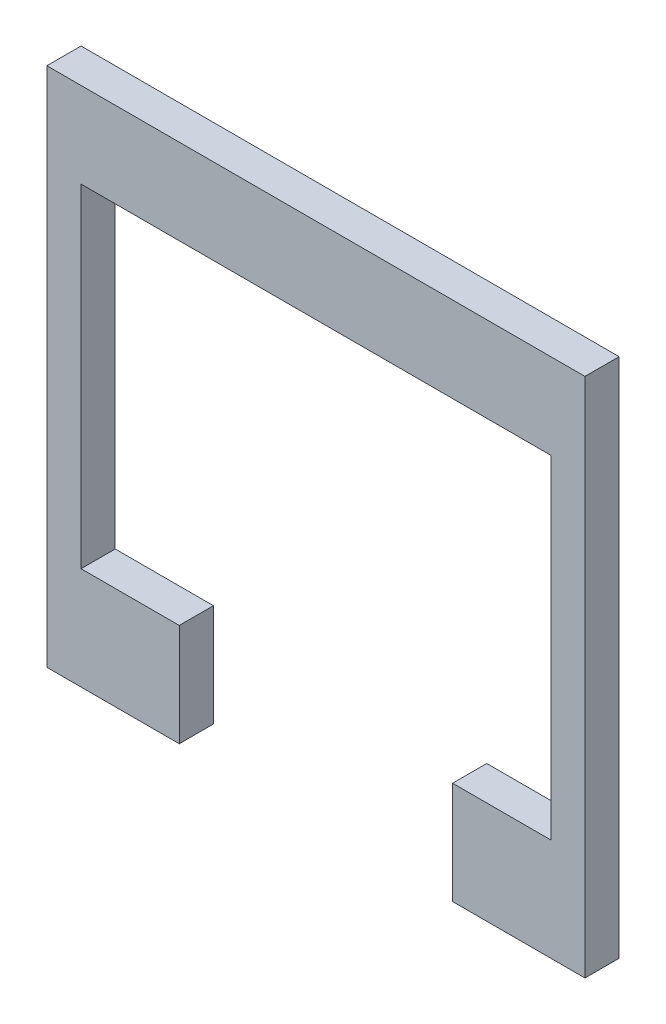
ISO-10303-21;
HEADER;
FILE_DESCRIPTION(('STEP AP214'),'2;1');
FILE_NAME('part.step','',(''),(''),'','','');
FILE_SCHEMA(('AUTOMOTIVE_DESIGN { 1 0 10303 214 1 1 1 1 }'));
ENDSEC;
DATA;
#1=APPLICATION_CONTEXT('core data for automotive mechanical design processes');
#2=APPLICATION_PROTOCOL_DEFINITION('international standard','automotive_design',2000,#1);
#3=PRODUCT_CONTEXT('',#1,'mechanical');
#4=PRODUCT('Part','Part','',(#3));
#5=PRODUCT_RELATED_PRODUCT_CATEGORY('part','',(#4));
#6=PRODUCT_DEFINITION_FORMATION('','',#4);
#7=PRODUCT_DEFINITION_CONTEXT('part definition',#1,'design');
#8=PRODUCT_DEFINITION('design','',#6,#7);
#9=PRODUCT_DEFINITION_SHAPE('','',#8);
#10=(LENGTH_UNIT() NAMED_UNIT(*) SI_UNIT(.MILLI.,.METRE.));
#11=(NAMED_UNIT(*) PLANE_ANGLE_UNIT() SI_UNIT($,.RADIAN.));
#12=(NAMED_UNIT(*) SI_UNIT($,.STERADIAN.) SOLID_ANGLE_UNIT());
#13=UNCERTAINTY_MEASURE_WITH_UNIT(LENGTH_MEASURE(1.E-05),#10,'distance_accuracy_value','');
#14=(GEOMETRIC_REPRESENTATION_CONTEXT(3) GLOBAL_UNCERTAINTY_ASSIGNED_CONTEXT((#13)) GLOBAL_UNIT_ASSIGNED_CONTEXT((#10,
#11,#12)) REPRESENTATION_CONTEXT('',''));
#15=CARTESIAN_POINT('',(0.,0.,0.));
#16=DIRECTION('',(0.,0.,1.));
#17=DIRECTION('',(1.,0.,0.));
#18=AXIS2_PLACEMENT_3D('',#15,#16,#17);
#19=CARTESIAN_POINT('',(13.75,-11.25,2.));
#20=DIRECTION('',(1.,0.,0.));
#21=DIRECTION('',(0.,0.,-1.));
#22=AXIS2_PLACEMENT_3D('',#19,#20,#21);
#23=PLANE('',#22);
#24=DIRECTION('',(0.,-1.,0.));
#25=VECTOR('',#24,1.);
#26=CARTESIAN_POINT('',(13.75,-11.25,0.));
#27=LINE('',#26,#25);
#28=CARTESIAN_POINT('',(13.75,8.25,0.));
#29=VERTEX_POINT('',#28);
#30=CARTESIAN_POINT('',(13.75,-11.25,0.));
#31=VERTEX_POINT('',#30);
#32=EDGE_CURVE('E153',#29,#31,#27,.T.);
#33=ORIENTED_EDGE('',*,*,#32,.T.);
#34=DIRECTION('',(0.,0.,-1.));
#35=VECTOR('',#34,1.);
#36=CARTESIAN_POINT('',(13.75,-11.25,2.));
#37=LINE('',#36,#35);
#38=CARTESIAN_POINT('',(13.75,-11.25,2.));
#39=VERTEX_POINT('',#38);
#40=EDGE_CURVE('E11',#39,#31,#37,.T.);
#41=ORIENTED_EDGE('',*,*,#40,.F.);
#42=DIRECTION('',(0.,-1.,0.));
#43=VECTOR('',#42,1.);
#44=CARTESIAN_POINT('',(13.75,-11.25,2.));
#45=LINE('',#44,#43);
#46=CARTESIAN_POINT('',(13.75,8.25,2.));
#47=VERTEX_POINT('',#46);
#48=EDGE_CURVE('E175',#47,#39,#45,.T.);
#49=ORIENTED_EDGE('',*,*,#48,.F.);
#50=DIRECTION('',(0.,0.,-1.));
#51=VECTOR('',#50,1.);
#52=CARTESIAN_POINT('',(13.75,8.25,2.));
#53=LINE('',#52,#51);
#54=EDGE_CURVE('E149',#47,#29,#53,.T.);
#55=ORIENTED_EDGE('',*,*,#54,.T.);
#56=EDGE_LOOP('',(#33,#41,#49,#55));
#57=FACE_BOUND('',#56,.T.);
#58=ADVANCED_FACE('F33',(#57),#23,.F.);
#59=CARTESIAN_POINT('',(8.,-11.25,2.));
#60=DIRECTION('',(0.,-1.,0.));
#61=DIRECTION('',(0.,0.,-1.));
#62=AXIS2_PLACEMENT_3D('',#59,#60,#61);
#63=PLANE('',#62);
#64=DIRECTION('',(-1.,0.,0.));
#65=VECTOR('',#64,1.);
#66=CARTESIAN_POINT('',(8.,-11.25,0.));
#67=LINE('',#66,#65);
#68=CARTESIAN_POINT('',(8.,-11.25,0.));
#69=VERTEX_POINT('',#68);
#70=EDGE_CURVE('E156',#31,#69,#67,.T.);
#71=ORIENTED_EDGE('',*,*,#70,.T.);
#72=DIRECTION('',(0.,0.,-1.));
#73=VECTOR('',#72,1.);
#74=CARTESIAN_POINT('',(8.,-11.25,2.));
#75=LINE('',#74,#73);
#76=CARTESIAN_POINT('',(8.,-11.25,2.));
#77=VERTEX_POINT('',#76);
#78=EDGE_CURVE('E41',#77,#69,#75,.T.);
#79=ORIENTED_EDGE('',*,*,#78,.F.);
#80=DIRECTION('',(-1.,0.,0.));
#81=VECTOR('',#80,1.);
#82=CARTESIAN_POINT('',(8.,-11.25,2.));
#83=LINE('',#82,#81);
#84=EDGE_CURVE('E104',#39,#77,#83,.T.);
#85=ORIENTED_EDGE('',*,*,#84,.F.);
#86=ORIENTED_EDGE('',*,*,#40,.T.);
#87=EDGE_LOOP('',(#71,#79,#85,#86));
#88=FACE_BOUND('',#87,.T.);
#89=ADVANCED_FACE('F253',(#88),#63,.F.);
#90=CARTESIAN_POINT('',(8.,-11.25,2.));
#91=DIRECTION('',(1.,0.,0.));
#92=DIRECTION('',(0.,0.,-1.));
#93=AXIS2_PLACEMENT_3D('',#90,#91,#92);
#94=PLANE('',#93);
#95=DIRECTION('',(0.,-1.,0.));
#96=VECTOR('',#95,1.);
#97=CARTESIAN_POINT('',(8.,-11.25,0.));
#98=LINE('',#97,#96);
#99=CARTESIAN_POINT('',(8.,-17.25,0.));
#100=VERTEX_POINT('',#99);
#101=EDGE_CURVE('E158',#69,#100,#98,.T.);
#102=ORIENTED_EDGE('',*,*,#101,.T.);
#103=DIRECTION('',(0.,0.,-1.));
#104=VECTOR('',#103,1.);
#105=CARTESIAN_POINT('',(8.,-17.25,2.));
#106=LINE('',#105,#104);
#107=CARTESIAN_POINT('',(8.,-17.25,2.));
#108=VERTEX_POINT('',#107);
#109=EDGE_CURVE('E194',#108,#100,#106,.T.);
#110=ORIENTED_EDGE('',*,*,#109,.F.);
#111=DIRECTION('',(0.,-1.,0.));
#112=VECTOR('',#111,1.);
#113=CARTESIAN_POINT('',(8.,-11.25,2.));
#114=LINE('',#113,#112);
#115=EDGE_CURVE('E202',#77,#108,#114,.T.);
#116=ORIENTED_EDGE('',*,*,#115,.F.);
#117=ORIENTED_EDGE('',*,*,#78,.T.);
#118=EDGE_LOOP('',(#102,#110,#116,#117));
#119=FACE_BOUND('',#118,.T.);
#120=ADVANCED_FACE('F200',(#119),#94,.F.);
#121=CARTESIAN_POINT('',(8.,-17.25,2.));
#122=DIRECTION('',(0.,1.,0.));
#123=DIRECTION('',(0.,0.,1.));
#124=AXIS2_PLACEMENT_3D('',#121,#122,#123);
#125=PLANE('',#124);
#126=DIRECTION('',(1.,0.,0.));
#127=VECTOR('',#126,1.);
#128=CARTESIAN_POINT('',(8.,-17.25,0.));
#129=LINE('',#128,#127);
#130=CARTESIAN_POINT('',(15.75,-17.25,0.));
#131=VERTEX_POINT('',#130);
#132=EDGE_CURVE('E160',#100,#131,#129,.T.);
#133=ORIENTED_EDGE('',*,*,#132,.T.);
#134=DIRECTION('',(0.,0.,-1.));
#135=VECTOR('',#134,1.);
#136=CARTESIAN_POINT('',(15.75,-17.25,2.));
#137=LINE('',#136,#135);
#138=CARTESIAN_POINT('',(15.75,-17.25,2.));
#139=VERTEX_POINT('',#138);
#140=EDGE_CURVE('E191',#139,#131,#137,.T.);
#141=ORIENTED_EDGE('',*,*,#140,.F.);
#142=DIRECTION('',(1.,0.,0.));
#143=VECTOR('',#142,1.);
#144=CARTESIAN_POINT('',(8.,-17.25,2.));
#145=LINE('',#144,#143);
#146=EDGE_CURVE('E220',#108,#139,#145,.T.);
#147=ORIENTED_EDGE('',*,*,#146,.F.);
#148=ORIENTED_EDGE('',*,*,#109,.T.);
#149=EDGE_LOOP('',(#133,#141,#147,#148));
#150=FACE_BOUND('',#149,.T.);
#151=ADVANCED_FACE('F211',(#150),#125,.F.);
#152=CARTESIAN_POINT('',(15.75,13.25,2.));
#153=DIRECTION('',(-1.,0.,0.));
#154=DIRECTION('',(0.,0.,1.));
#155=AXIS2_PLACEMENT_3D('',#152,#153,#154);
#156=PLANE('',#155);
#157=DIRECTION('',(0.,1.,0.));
#158=VECTOR('',#157,1.);
#159=CARTESIAN_POINT('',(15.75,13.25,0.));
#160=LINE('',#159,#158);
#161=CARTESIAN_POINT('',(15.75,13.25,0.));
#162=VERTEX_POINT('',#161);
#163=EDGE_CURVE('E162',#131,#162,#160,.T.);
#164=ORIENTED_EDGE('',*,*,#163,.T.);
#165=DIRECTION('',(0.,0.,-1.));
#166=VECTOR('',#165,1.);
#167=CARTESIAN_POINT('',(15.75,13.25,2.));
#168=LINE('',#167,#166);
#169=CARTESIAN_POINT('',(15.75,13.25,2.));
#170=VERTEX_POINT('',#169);
#171=EDGE_CURVE('E188',#170,#162,#168,.T.);
#172=ORIENTED_EDGE('',*,*,#171,.F.);
#173=DIRECTION('',(0.,1.,0.));
#174=VECTOR('',#173,1.);
#175=CARTESIAN_POINT('',(15.75,13.25,2.));
#176=LINE('',#175,#174);
#177=EDGE_CURVE('E217',#139,#170,#176,.T.);
#178=ORIENTED_EDGE('',*,*,#177,.F.);
#179=ORIENTED_EDGE('',*,*,#140,.T.);
#180=EDGE_LOOP('',(#164,#172,#178,#179));
#181=FACE_BOUND('',#180,.T.);
#182=ADVANCED_FACE('F215',(#181),#156,.F.);
#183=CARTESIAN_POINT('',(-15.75,13.25,2.));
#184=DIRECTION('',(0.,-1.,0.));
#185=DIRECTION('',(0.,0.,-1.));
#186=AXIS2_PLACEMENT_3D('',#183,#184,#185);
#187=PLANE('',#186);
#188=DIRECTION('',(-1.,0.,0.));
#189=VECTOR('',#188,1.);
#190=CARTESIAN_POINT('',(-15.75,13.25,0.));
#191=LINE('',#190,#189);
#192=CARTESIAN_POINT('',(-15.75,13.25,0.));
#193=VERTEX_POINT('',#192);
#194=EDGE_CURVE('E164',#162,#193,#191,.T.);
#195=ORIENTED_EDGE('',*,*,#194,.T.);
#196=DIRECTION('',(0.,0.,-1.));
#197=VECTOR('',#196,1.);
#198=CARTESIAN_POINT('',(-15.75,13.25,2.));
#199=LINE('',#198,#197);
#200=CARTESIAN_POINT('',(-15.75,13.25,2.));
#201=VERTEX_POINT('',#200);
#202=EDGE_CURVE('E185',#201,#193,#199,.T.);
#203=ORIENTED_EDGE('',*,*,#202,.F.);
#204=DIRECTION('',(-1.,0.,0.));
#205=VECTOR('',#204,1.);
#206=CARTESIAN_POINT('',(-15.75,13.25,2.));
#207=LINE('',#206,#205);
#208=EDGE_CURVE('E219',#170,#201,#207,.T.);
#209=ORIENTED_EDGE('',*,*,#208,.F.);
#210=ORIENTED_EDGE('',*,*,#171,.T.);
#211=EDGE_LOOP('',(#195,#203,#209,#210));
#212=FACE_BOUND('',#211,.T.);
#213=ADVANCED_FACE('F266',(#212),#187,.F.);
#214=CARTESIAN_POINT('',(-15.75,13.25,2.));
#215=DIRECTION('',(1.,0.,0.));
#216=DIRECTION('',(0.,0.,-1.));
#217=AXIS2_PLACEMENT_3D('',#214,#215,#216);
#218=PLANE('',#217);
#219=DIRECTION('',(0.,-1.,0.));
#220=VECTOR('',#219,1.);
#221=CARTESIAN_POINT('',(-15.75,13.25,0.));
#222=LINE('',#221,#220);
#223=CARTESIAN_POINT('',(-15.75,-17.25,0.));
#224=VERTEX_POINT('',#223);
#225=EDGE_CURVE('E166',#193,#224,#222,.T.);
#226=ORIENTED_EDGE('',*,*,#225,.T.);
#227=DIRECTION('',(0.,0.,-1.));
#228=VECTOR('',#227,1.);
#229=CARTESIAN_POINT('',(-15.75,-17.25,2.));
#230=LINE('',#229,#228);
#231=CARTESIAN_POINT('',(-15.75,-17.25,2.));
#232=VERTEX_POINT('',#231);
#233=EDGE_CURVE('E182',#232,#224,#230,.T.);
#234=ORIENTED_EDGE('',*,*,#233,.F.);
#235=DIRECTION('',(0.,-1.,0.));
#236=VECTOR('',#235,1.);
#237=CARTESIAN_POINT('',(-15.75,13.25,2.));
#238=LINE('',#237,#236);
#239=EDGE_CURVE('E222',#201,#232,#238,.T.);
#240=ORIENTED_EDGE('',*,*,#239,.F.);
#241=ORIENTED_EDGE('',*,*,#202,.T.);
#242=EDGE_LOOP('',(#226,#234,#240,#241));
#243=FACE_BOUND('',#242,.T.);
#244=ADVANCED_FACE('F269',(#243),#218,.F.);
#245=CARTESIAN_POINT('',(-15.75,-17.25,2.));
#246=DIRECTION('',(0.,1.,0.));
#247=DIRECTION('',(0.,0.,1.));
#248=AXIS2_PLACEMENT_3D('',#245,#246,#247);
#249=PLANE('',#248);
#250=DIRECTION('',(1.,0.,0.));
#251=VECTOR('',#250,1.);
#252=CARTESIAN_POINT('',(-15.75,-17.25,0.));
#253=LINE('',#252,#251);
#254=CARTESIAN_POINT('',(-8.,-17.25,0.));
#255=VERTEX_POINT('',#254);
#256=EDGE_CURVE('E168',#224,#255,#253,.T.);
#257=ORIENTED_EDGE('',*,*,#256,.T.);
#258=DIRECTION('',(0.,0.,-1.));
#259=VECTOR('',#258,1.);
#260=CARTESIAN_POINT('',(-8.,-17.25,2.));
#261=LINE('',#260,#259);
#262=CARTESIAN_POINT('',(-8.,-17.25,2.));
#263=VERTEX_POINT('',#262);
#264=EDGE_CURVE('E179',#263,#255,#261,.T.);
#265=ORIENTED_EDGE('',*,*,#264,.F.);
#266=DIRECTION('',(1.,0.,0.));
#267=VECTOR('',#266,1.);
#268=CARTESIAN_POINT('',(-15.75,-17.25,2.));
#269=LINE('',#268,#267);
#270=EDGE_CURVE('E228',#232,#263,#269,.T.);
#271=ORIENTED_EDGE('',*,*,#270,.F.);
#272=ORIENTED_EDGE('',*,*,#233,.T.);
#273=EDGE_LOOP('',(#257,#265,#271,#272));
#274=FACE_BOUND('',#273,.T.);
#275=ADVANCED_FACE('F234',(#274),#249,.F.);
#276=CARTESIAN_POINT('',(-8.,-11.25,2.));
#277=DIRECTION('',(-1.,0.,0.));
#278=DIRECTION('',(0.,0.,1.));
#279=AXIS2_PLACEMENT_3D('',#276,#277,#278);
#280=PLANE('',#279);
#281=DIRECTION('',(0.,1.,0.));
#282=VECTOR('',#281,1.);
#283=CARTESIAN_POINT('',(-8.,-11.25,0.));
#284=LINE('',#283,#282);
#285=CARTESIAN_POINT('',(-8.,-11.25,0.));
#286=VERTEX_POINT('',#285);
#287=EDGE_CURVE('E170',#255,#286,#284,.T.);
#288=ORIENTED_EDGE('',*,*,#287,.T.);
#289=DIRECTION('',(0.,0.,-1.));
#290=VECTOR('',#289,1.);
#291=CARTESIAN_POINT('',(-8.,-11.25,2.));
#292=LINE('',#291,#290);
#293=CARTESIAN_POINT('',(-8.,-11.25,2.));
#294=VERTEX_POINT('',#293);
#295=EDGE_CURVE('E144',#294,#286,#292,.T.);
#296=ORIENTED_EDGE('',*,*,#295,.F.);
#297=DIRECTION('',(0.,1.,0.));
#298=VECTOR('',#297,1.);
#299=CARTESIAN_POINT('',(-8.,-11.25,2.));
#300=LINE('',#299,#298);
#301=EDGE_CURVE('E135',#263,#294,#300,.T.);
#302=ORIENTED_EDGE('',*,*,#301,.F.);
#303=ORIENTED_EDGE('',*,*,#264,.T.);
#304=EDGE_LOOP('',(#288,#296,#302,#303));
#305=FACE_BOUND('',#304,.T.);
#306=ADVANCED_FACE('F238',(#305),#280,.F.);
#307=CARTESIAN_POINT('',(-13.75,-11.25,2.));
#308=DIRECTION('',(0.,-1.,0.));
#309=DIRECTION('',(0.,0.,-1.));
#310=AXIS2_PLACEMENT_3D('',#307,#308,#309);
#311=PLANE('',#310);
#312=DIRECTION('',(-1.,0.,0.));
#313=VECTOR('',#312,1.);
#314=CARTESIAN_POINT('',(-13.75,-11.25,0.));
#315=LINE('',#314,#313);
#316=CARTESIAN_POINT('',(-13.75,-11.25,0.));
#317=VERTEX_POINT('',#316);
#318=EDGE_CURVE('E143',#286,#317,#315,.T.);
#319=ORIENTED_EDGE('',*,*,#318,.T.);
#320=DIRECTION('',(0.,0.,-1.));
#321=VECTOR('',#320,1.);
#322=CARTESIAN_POINT('',(-13.75,-11.25,2.));
#323=LINE('',#322,#321);
#324=CARTESIAN_POINT('',(-13.75,-11.25,2.));
#325=VERTEX_POINT('',#324);
#326=EDGE_CURVE('E140',#325,#317,#323,.T.);
#327=ORIENTED_EDGE('',*,*,#326,.F.);
#328=DIRECTION('',(-1.,0.,0.));
#329=VECTOR('',#328,1.);
#330=CARTESIAN_POINT('',(-13.75,-11.25,2.));
#331=LINE('',#330,#329);
#332=EDGE_CURVE('E129',#294,#325,#331,.T.);
#333=ORIENTED_EDGE('',*,*,#332,.F.);
#334=ORIENTED_EDGE('',*,*,#295,.T.);
#335=EDGE_LOOP('',(#319,#327,#333,#334));
#336=FACE_BOUND('',#335,.T.);
#337=ADVANCED_FACE('F141',(#336),#311,.F.);
#338=CARTESIAN_POINT('',(-13.75,-11.25,2.));
#339=DIRECTION('',(-1.,0.,0.));
#340=DIRECTION('',(0.,0.,1.));
#341=AXIS2_PLACEMENT_3D('',#338,#339,#340);
#342=PLANE('',#341);
#343=DIRECTION('',(0.,1.,0.));
#344=VECTOR('',#343,1.);
#345=CARTESIAN_POINT('',(-13.75,-11.25,0.));
#346=LINE('',#345,#344);
#347=CARTESIAN_POINT('',(-13.75,8.25,0.));
#348=VERTEX_POINT('',#347);
#349=EDGE_CURVE('E90',#317,#348,#346,.T.);
#350=ORIENTED_EDGE('',*,*,#349,.T.);
#351=DIRECTION('',(0.,0.,-1.));
#352=VECTOR('',#351,1.);
#353=CARTESIAN_POINT('',(-13.75,8.25,2.));
#354=LINE('',#353,#352);
#355=CARTESIAN_POINT('',(-13.75,8.25,2.));
#356=VERTEX_POINT('',#355);
#357=EDGE_CURVE('E145',#356,#348,#354,.T.);
#358=ORIENTED_EDGE('',*,*,#357,.F.);
#359=DIRECTION('',(0.,1.,0.));
#360=VECTOR('',#359,1.);
#361=CARTESIAN_POINT('',(-13.75,-11.25,2.));
#362=LINE('',#361,#360);
#363=EDGE_CURVE('E133',#325,#356,#362,.T.);
#364=ORIENTED_EDGE('',*,*,#363,.F.);
#365=ORIENTED_EDGE('',*,*,#326,.T.);
#366=EDGE_LOOP('',(#350,#358,#364,#365));
#367=FACE_BOUND('',#366,.T.);
#368=ADVANCED_FACE('F147',(#367),#342,.F.);
#369=CARTESIAN_POINT('',(-13.75,8.25,2.));
#370=DIRECTION('',(0.,1.,0.));
#371=DIRECTION('',(0.,0.,1.));
#372=AXIS2_PLACEMENT_3D('',#369,#370,#371);
#373=PLANE('',#372);
#374=DIRECTION('',(1.,0.,0.));
#375=VECTOR('',#374,1.);
#376=CARTESIAN_POINT('',(-13.75,8.25,0.));
#377=LINE('',#376,#375);
#378=EDGE_CURVE('E96',#348,#29,#377,.T.);
#379=ORIENTED_EDGE('',*,*,#378,.T.);
#380=ORIENTED_EDGE('',*,*,#54,.F.);
#381=DIRECTION('',(1.,0.,0.));
#382=VECTOR('',#381,1.);
#383=CARTESIAN_POINT('',(-13.75,8.25,2.));
#384=LINE('',#383,#382);
#385=EDGE_CURVE('E49',#356,#47,#384,.T.);
#386=ORIENTED_EDGE('',*,*,#385,.F.);
#387=ORIENTED_EDGE('',*,*,#357,.T.);
#388=EDGE_LOOP('',(#379,#380,#386,#387));
#389=FACE_BOUND('',#388,.T.);
#390=ADVANCED_FACE('F242',(#389),#373,.F.);
#391=CARTESIAN_POINT('',(0.,0.,2.));
#392=DIRECTION('',(0.,0.,-1.));
#393=DIRECTION('',(-1.,0.,0.));
#394=AXIS2_PLACEMENT_3D('',#391,#392,#393);
#395=PLANE('',#394);
#396=ORIENTED_EDGE('',*,*,#48,.T.);
#397=ORIENTED_EDGE('',*,*,#84,.T.);
#398=ORIENTED_EDGE('',*,*,#115,.T.);
#399=ORIENTED_EDGE('',*,*,#146,.T.);
#400=ORIENTED_EDGE('',*,*,#177,.T.);
#401=ORIENTED_EDGE('',*,*,#208,.T.);
#402=ORIENTED_EDGE('',*,*,#239,.T.);
#403=ORIENTED_EDGE('',*,*,#270,.T.);
#404=ORIENTED_EDGE('',*,*,#301,.T.);
#405=ORIENTED_EDGE('',*,*,#332,.T.);
#406=ORIENTED_EDGE('',*,*,#363,.T.);
#407=ORIENTED_EDGE('',*,*,#385,.T.);
#408=EDGE_LOOP('',(#396,#397,#398,#399,#400,#401,#402,#403,#404,#405,#406,#407));
#409=FACE_BOUND('',#408,.T.);
#410=ADVANCED_FACE('F131',(#409),#395,.F.);
#411=CARTESIAN_POINT('',(0.,0.,0.));
#412=DIRECTION('',(0.,0.,-1.));
#413=DIRECTION('',(-1.,0.,0.));
#414=AXIS2_PLACEMENT_3D('',#411,#412,#413);
#415=PLANE('',#414);
#416=ORIENTED_EDGE('',*,*,#32,.F.);
#417=ORIENTED_EDGE('',*,*,#378,.F.);
#418=ORIENTED_EDGE('',*,*,#349,.F.);
#419=ORIENTED_EDGE('',*,*,#318,.F.);
#420=ORIENTED_EDGE('',*,*,#287,.F.);
#421=ORIENTED_EDGE('',*,*,#256,.F.);
#422=ORIENTED_EDGE('',*,*,#225,.F.);
#423=ORIENTED_EDGE('',*,*,#194,.F.);
#424=ORIENTED_EDGE('',*,*,#163,.F.);
#425=ORIENTED_EDGE('',*,*,#132,.F.);
#426=ORIENTED_EDGE('',*,*,#101,.F.);
#427=ORIENTED_EDGE('',*,*,#70,.F.);
#428=EDGE_LOOP('',(#416,#417,#418,#419,#420,#421,#422,#423,#424,#425,#426,#427));
#429=FACE_BOUND('',#428,.T.);
#430=ADVANCED_FACE('F206',(#429),#415,.T.);
#431=CLOSED_SHELL('',(#58,#89,#120,#151,#182,#213,#244,#275,#306,#337,#368,#390,#410,#430));
#432=MANIFOLD_SOLID_BREP('B2',#431);
#433=ADVANCED_BREP_SHAPE_REPRESENTATION('',(#18,#432),#14);
#434=SHAPE_DEFINITION_REPRESENTATION(#9,#433);
ENDSEC;
END-ISO-10303-21;
